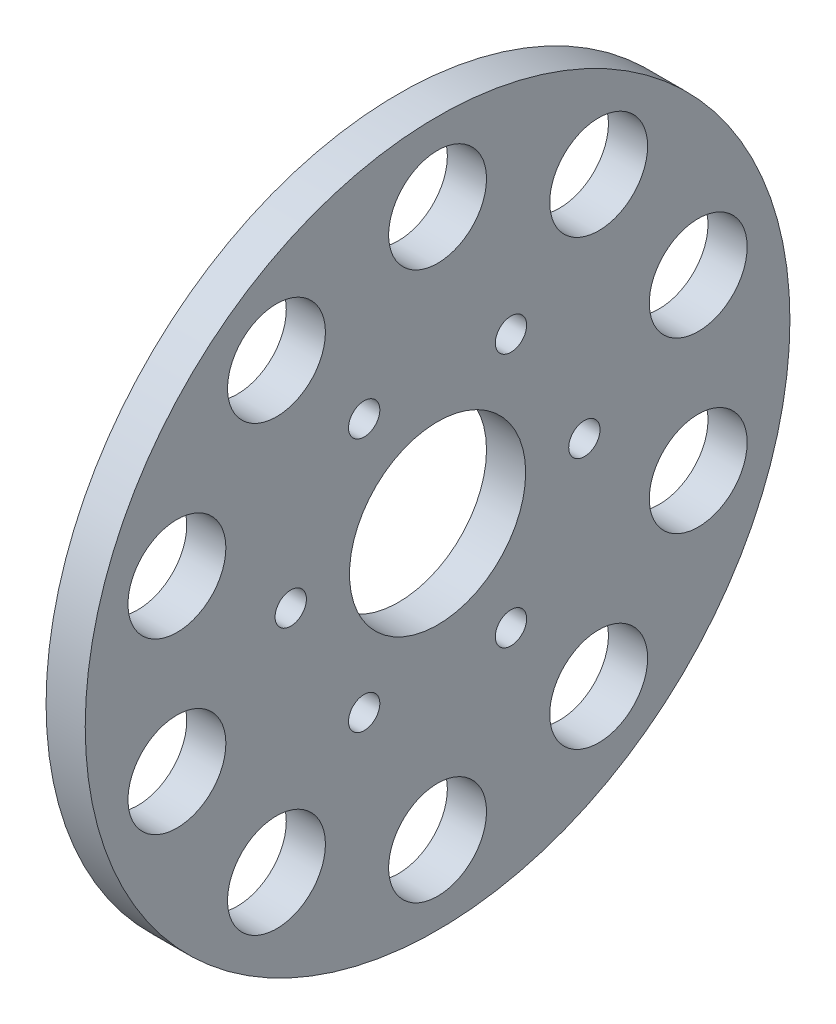
ISO-10303-21;
HEADER;
FILE_DESCRIPTION(('STEP AP214'),'2;1');
FILE_NAME('part.step','',(''),(''),'','','');
FILE_SCHEMA(('AUTOMOTIVE_DESIGN { 1 0 10303 214 1 1 1 1 }'));
ENDSEC;
DATA;
#1=APPLICATION_CONTEXT('core data for automotive mechanical design processes');
#2=APPLICATION_PROTOCOL_DEFINITION('international standard','automotive_design',2000,#1);
#3=PRODUCT_CONTEXT('',#1,'mechanical');
#4=PRODUCT('Part','Part','',(#3));
#5=PRODUCT_RELATED_PRODUCT_CATEGORY('part','',(#4));
#6=PRODUCT_DEFINITION_FORMATION('','',#4);
#7=PRODUCT_DEFINITION_CONTEXT('part definition',#1,'design');
#8=PRODUCT_DEFINITION('design','',#6,#7);
#9=PRODUCT_DEFINITION_SHAPE('','',#8);
#10=(LENGTH_UNIT() NAMED_UNIT(*) SI_UNIT(.MILLI.,.METRE.));
#11=(NAMED_UNIT(*) PLANE_ANGLE_UNIT() SI_UNIT($,.RADIAN.));
#12=(NAMED_UNIT(*) SI_UNIT($,.STERADIAN.) SOLID_ANGLE_UNIT());
#13=UNCERTAINTY_MEASURE_WITH_UNIT(LENGTH_MEASURE(1.E-05),#10,'distance_accuracy_value','');
#14=(GEOMETRIC_REPRESENTATION_CONTEXT(3) GLOBAL_UNCERTAINTY_ASSIGNED_CONTEXT((#13)) GLOBAL_UNIT_ASSIGNED_CONTEXT((#10,
#11,#12)) REPRESENTATION_CONTEXT('',''));
#15=CARTESIAN_POINT('',(0.,0.,0.));
#16=DIRECTION('',(0.,0.,1.));
#17=DIRECTION('',(1.,0.,0.));
#18=AXIS2_PLACEMENT_3D('',#15,#16,#17);
#19=CARTESIAN_POINT('',(6.35,0.,0.));
#20=DIRECTION('',(1.,0.,0.));
#21=DIRECTION('',(0.,0.,-1.));
#22=AXIS2_PLACEMENT_3D('',#19,#20,#21);
#23=PLANE('',#22);
#24=CARTESIAN_POINT('',(6.35,3.21813894591598E-12,-23.8125));
#25=DIRECTION('',(1.,0.,0.));
#26=DIRECTION('',(0.,0.,-1.));
#27=AXIS2_PLACEMENT_3D('',#24,#25,#26);
#28=CIRCLE('',#27,2.54);
#29=CARTESIAN_POINT('',(6.35,3.21813894591598E-12,-26.3525));
#30=VERTEX_POINT('',#29);
#31=EDGE_CURVE('E140',#30,#30,#28,.F.);
#32=ORIENTED_EDGE('',*,*,#31,.T.);
#33=EDGE_LOOP('',(#32));
#34=FACE_BOUND('',#33,.T.);
#35=CARTESIAN_POINT('',(6.35,20.6222299276193,-11.9062499999985));
#36=DIRECTION('',(1.,0.,0.));
#37=DIRECTION('',(0.,0.,-1.));
#38=AXIS2_PLACEMENT_3D('',#35,#36,#37);
#39=CIRCLE('',#38,2.54);
#40=CARTESIAN_POINT('',(6.35,20.6222299276193,-14.4462499999985));
#41=VERTEX_POINT('',#40);
#42=EDGE_CURVE('E134',#41,#41,#39,.F.);
#43=ORIENTED_EDGE('',*,*,#42,.T.);
#44=EDGE_LOOP('',(#43));
#45=FACE_BOUND('',#44,.T.);
#46=CARTESIAN_POINT('',(6.35,20.6222299276175,11.9062500000015));
#47=DIRECTION('',(1.,0.,0.));
#48=DIRECTION('',(0.,0.,-1.));
#49=AXIS2_PLACEMENT_3D('',#46,#47,#48);
#50=CIRCLE('',#49,2.54);
#51=CARTESIAN_POINT('',(6.35,20.6222299276175,9.36625000000155));
#52=VERTEX_POINT('',#51);
#53=EDGE_CURVE('E128',#52,#52,#50,.F.);
#54=ORIENTED_EDGE('',*,*,#53,.T.);
#55=EDGE_LOOP('',(#54));
#56=FACE_BOUND('',#55,.T.);
#57=CARTESIAN_POINT('',(6.35,-3.36908886205967E-13,23.8125));
#58=DIRECTION('',(1.,0.,0.));
#59=DIRECTION('',(0.,0.,-1.));
#60=AXIS2_PLACEMENT_3D('',#57,#58,#59);
#61=CIRCLE('',#60,2.54);
#62=CARTESIAN_POINT('',(6.35,-3.36908886205967E-13,21.2725));
#63=VERTEX_POINT('',#62);
#64=EDGE_CURVE('E122',#63,#63,#61,.F.);
#65=ORIENTED_EDGE('',*,*,#64,.T.);
#66=EDGE_LOOP('',(#65));
#67=FACE_BOUND('',#66,.T.);
#68=CARTESIAN_POINT('',(6.35,-20.6222299276164,11.9062499999984));
#69=DIRECTION('',(1.,0.,0.));
#70=DIRECTION('',(0.,0.,-1.));
#71=AXIS2_PLACEMENT_3D('',#68,#69,#70);
#72=CIRCLE('',#71,2.54);
#73=CARTESIAN_POINT('',(6.35,-20.6222299276164,9.36624999999845));
#74=VERTEX_POINT('',#73);
#75=EDGE_CURVE('E116',#74,#74,#72,.F.);
#76=ORIENTED_EDGE('',*,*,#75,.T.);
#77=EDGE_LOOP('',(#76));
#78=FACE_BOUND('',#77,.T.);
#79=CARTESIAN_POINT('',(6.35,-20.6222299276146,-11.9062500000016));
#80=DIRECTION('',(1.,0.,0.));
#81=DIRECTION('',(0.,0.,-1.));
#82=AXIS2_PLACEMENT_3D('',#79,#80,#81);
#83=CIRCLE('',#82,2.54);
#84=CARTESIAN_POINT('',(6.35,-20.6222299276146,-14.4462500000015));
#85=VERTEX_POINT('',#84);
#86=EDGE_CURVE('E110',#85,#85,#83,.F.);
#87=ORIENTED_EDGE('',*,*,#86,.T.);
#88=EDGE_LOOP('',(#87));
#89=FACE_BOUND('',#88,.T.);
#90=CARTESIAN_POINT('',(6.35,13.7358053999646,42.2744621493183));
#91=DIRECTION('',(1.,0.,0.));
#92=DIRECTION('',(0.,0.,-1.));
#93=AXIS2_PLACEMENT_3D('',#90,#91,#92);
#94=CIRCLE('',#93,7.93750000000225);
#95=CARTESIAN_POINT('',(6.35,13.7358053999646,34.336962149316));
#96=VERTEX_POINT('',#95);
#97=EDGE_CURVE('E95',#96,#96,#94,.T.);
#98=ORIENTED_EDGE('',*,*,#97,.F.);
#99=EDGE_LOOP('',(#98));
#100=FACE_BOUND('',#99,.T.);
#101=CARTESIAN_POINT('',(6.35,-35.9608053999675,26.127054464397));
#102=DIRECTION('',(1.,0.,0.));
#103=DIRECTION('',(0.,0.,-1.));
#104=AXIS2_PLACEMENT_3D('',#101,#102,#103);
#105=CIRCLE('',#104,7.9375000000013);
#106=CARTESIAN_POINT('',(6.35,-35.9608053999675,18.1895544643957));
#107=VERTEX_POINT('',#106);
#108=EDGE_CURVE('E83',#107,#107,#105,.T.);
#109=ORIENTED_EDGE('',*,*,#108,.F.);
#110=EDGE_LOOP('',(#109));
#111=FACE_BOUND('',#110,.T.);
#112=CARTESIAN_POINT('',(6.35,-13.7358053999645,-42.2744621493216));
#113=DIRECTION('',(1.,0.,0.));
#114=DIRECTION('',(0.,0.,-1.));
#115=AXIS2_PLACEMENT_3D('',#112,#113,#114);
#116=CIRCLE('',#115,7.9375);
#117=CARTESIAN_POINT('',(6.35,-13.7358053999645,-50.2119621493216));
#118=VERTEX_POINT('',#117);
#119=EDGE_CURVE('E71',#118,#118,#116,.T.);
#120=ORIENTED_EDGE('',*,*,#119,.F.);
#121=EDGE_LOOP('',(#120));
#122=FACE_BOUND('',#121,.T.);
#123=CARTESIAN_POINT('',(6.35,35.9608053999674,-26.1270544644013));
#124=DIRECTION('',(1.,0.,0.));
#125=DIRECTION('',(0.,0.,-1.));
#126=AXIS2_PLACEMENT_3D('',#123,#124,#125);
#127=CIRCLE('',#126,7.9375);
#128=CARTESIAN_POINT('',(6.35,35.9608053999674,-34.0645544644013));
#129=VERTEX_POINT('',#128);
#130=EDGE_CURVE('E59',#129,#129,#127,.T.);
#131=ORIENTED_EDGE('',*,*,#130,.F.);
#132=EDGE_LOOP('',(#131));
#133=FACE_BOUND('',#132,.T.);
#134=CARTESIAN_POINT('',(6.35,44.45,0.));
#135=DIRECTION('',(1.,0.,0.));
#136=DIRECTION('',(0.,0.,-1.));
#137=AXIS2_PLACEMENT_3D('',#134,#135,#136);
#138=CIRCLE('',#137,7.9375);
#139=CARTESIAN_POINT('',(6.35,44.45,-7.9375));
#140=VERTEX_POINT('',#139);
#141=EDGE_CURVE('E47',#140,#140,#138,.T.);
#142=ORIENTED_EDGE('',*,*,#141,.F.);
#143=EDGE_LOOP('',(#142));
#144=FACE_BOUND('',#143,.T.);
#145=CARTESIAN_POINT('',(6.35,0.,0.));
#146=DIRECTION('',(1.,0.,0.));
#147=DIRECTION('',(0.,0.,-1.));
#148=AXIS2_PLACEMENT_3D('',#145,#146,#147);
#149=CIRCLE('',#148,57.15);
#150=CARTESIAN_POINT('',(6.35,0.,-57.15));
#151=VERTEX_POINT('',#150);
#152=EDGE_CURVE('E10',#151,#151,#149,.T.);
#153=ORIENTED_EDGE('',*,*,#152,.T.);
#154=EDGE_LOOP('',(#153));
#155=FACE_BOUND('',#154,.T.);
#156=CARTESIAN_POINT('',(6.35,0.,0.));
#157=DIRECTION('',(1.,0.,0.));
#158=DIRECTION('',(0.,0.,-1.));
#159=AXIS2_PLACEMENT_3D('',#156,#157,#158);
#160=CIRCLE('',#159,14.2875);
#161=CARTESIAN_POINT('',(6.35,0.,-14.2875));
#162=VERTEX_POINT('',#161);
#163=EDGE_CURVE('E42',#162,#162,#160,.T.);
#164=ORIENTED_EDGE('',*,*,#163,.F.);
#165=EDGE_LOOP('',(#164));
#166=FACE_BOUND('',#165,.T.);
#167=CARTESIAN_POINT('',(6.35,-44.45,-3.77914784249995E-12));
#168=DIRECTION('',(1.,0.,0.));
#169=DIRECTION('',(0.,0.,-1.));
#170=AXIS2_PLACEMENT_3D('',#167,#168,#169);
#171=CIRCLE('',#170,7.93750000000076);
#172=CARTESIAN_POINT('',(6.35,-44.45,-7.93750000000454));
#173=VERTEX_POINT('',#172);
#174=EDGE_CURVE('E53',#173,#173,#171,.T.);
#175=ORIENTED_EDGE('',*,*,#174,.F.);
#176=EDGE_LOOP('',(#175));
#177=FACE_BOUND('',#176,.T.);
#178=CARTESIAN_POINT('',(6.35,13.7358053999681,-42.274462149321));
#179=DIRECTION('',(1.,0.,0.));
#180=DIRECTION('',(0.,0.,-1.));
#181=AXIS2_PLACEMENT_3D('',#178,#179,#180);
#182=CIRCLE('',#181,7.93750000000001);
#183=CARTESIAN_POINT('',(6.35,13.7358053999681,-50.211962149321));
#184=VERTEX_POINT('',#183);
#185=EDGE_CURVE('E65',#184,#184,#182,.T.);
#186=ORIENTED_EDGE('',*,*,#185,.F.);
#187=EDGE_LOOP('',(#186));
#188=FACE_BOUND('',#187,.T.);
#189=CARTESIAN_POINT('',(6.35,-35.9608053999647,-26.1270544644028));
#190=DIRECTION('',(1.,0.,0.));
#191=DIRECTION('',(0.,0.,-1.));
#192=AXIS2_PLACEMENT_3D('',#189,#190,#191);
#193=CIRCLE('',#192,7.93750000000001);
#194=CARTESIAN_POINT('',(6.35,-35.9608053999647,-34.0645544644028));
#195=VERTEX_POINT('',#194);
#196=EDGE_CURVE('E77',#195,#195,#193,.T.);
#197=ORIENTED_EDGE('',*,*,#196,.F.);
#198=EDGE_LOOP('',(#197));
#199=FACE_BOUND('',#198,.T.);
#200=CARTESIAN_POINT('',(6.35,-13.7358053999682,42.2744621493171));
#201=DIRECTION('',(1.,0.,0.));
#202=DIRECTION('',(0.,0.,-1.));
#203=AXIS2_PLACEMENT_3D('',#200,#201,#202);
#204=CIRCLE('',#203,7.93750000000186);
#205=CARTESIAN_POINT('',(6.35,-13.7358053999682,34.3369621493152));
#206=VERTEX_POINT('',#205);
#207=EDGE_CURVE('E89',#206,#206,#204,.T.);
#208=ORIENTED_EDGE('',*,*,#207,.F.);
#209=EDGE_LOOP('',(#208));
#210=FACE_BOUND('',#209,.T.);
#211=CARTESIAN_POINT('',(6.35,35.9608053999653,26.1270544644001));
#212=DIRECTION('',(1.,0.,0.));
#213=DIRECTION('',(0.,0.,-1.));
#214=AXIS2_PLACEMENT_3D('',#211,#212,#213);
#215=CIRCLE('',#214,7.9375000000012);
#216=CARTESIAN_POINT('',(6.35,35.9608053999653,18.1895544643989));
#217=VERTEX_POINT('',#216);
#218=EDGE_CURVE('E101',#217,#217,#215,.T.);
#219=ORIENTED_EDGE('',*,*,#218,.F.);
#220=EDGE_LOOP('',(#219));
#221=FACE_BOUND('',#220,.T.);
#222=ADVANCED_FACE('F31',(#34,#45,#56,#67,#78,#89,#100,#111,#122,#133,#144,#155,#166,#177,#188,
#199,#210,#221),#23,.T.);
#223=CARTESIAN_POINT('',(0.,0.,0.));
#224=DIRECTION('',(1.,0.,0.));
#225=DIRECTION('',(0.,0.,-1.));
#226=AXIS2_PLACEMENT_3D('',#223,#224,#225);
#227=PLANE('',#226);
#228=CARTESIAN_POINT('',(0.,3.21813894591598E-12,-23.8125));
#229=DIRECTION('',(-1.,0.,0.));
#230=DIRECTION('',(0.,0.,1.));
#231=AXIS2_PLACEMENT_3D('',#228,#229,#230);
#232=CIRCLE('',#231,2.54);
#233=CARTESIAN_POINT('',(0.,3.21813894591598E-12,-21.2725));
#234=VERTEX_POINT('',#233);
#235=EDGE_CURVE('E113',#234,#234,#232,.T.);
#236=ORIENTED_EDGE('',*,*,#235,.F.);
#237=EDGE_LOOP('',(#236));
#238=FACE_BOUND('',#237,.T.);
#239=CARTESIAN_POINT('',(0.,20.6222299276193,-11.9062499999985));
#240=DIRECTION('',(-1.,0.,0.));
#241=DIRECTION('',(0.,0.,1.));
#242=AXIS2_PLACEMENT_3D('',#239,#240,#241);
#243=CIRCLE('',#242,2.54);
#244=CARTESIAN_POINT('',(0.,20.6222299276193,-9.36624999999847));
#245=VERTEX_POINT('',#244);
#246=EDGE_CURVE('E137',#245,#245,#243,.T.);
#247=ORIENTED_EDGE('',*,*,#246,.F.);
#248=EDGE_LOOP('',(#247));
#249=FACE_BOUND('',#248,.T.);
#250=CARTESIAN_POINT('',(0.,20.6222299276175,11.9062500000015));
#251=DIRECTION('',(-1.,0.,0.));
#252=DIRECTION('',(0.,0.,1.));
#253=AXIS2_PLACEMENT_3D('',#250,#251,#252);
#254=CIRCLE('',#253,2.54);
#255=CARTESIAN_POINT('',(0.,20.6222299276175,14.4462500000015));
#256=VERTEX_POINT('',#255);
#257=EDGE_CURVE('E131',#256,#256,#254,.T.);
#258=ORIENTED_EDGE('',*,*,#257,.F.);
#259=EDGE_LOOP('',(#258));
#260=FACE_BOUND('',#259,.T.);
#261=CARTESIAN_POINT('',(0.,-3.36908886205967E-13,23.8125));
#262=DIRECTION('',(-1.,0.,0.));
#263=DIRECTION('',(0.,0.,1.));
#264=AXIS2_PLACEMENT_3D('',#261,#262,#263);
#265=CIRCLE('',#264,2.54);
#266=CARTESIAN_POINT('',(0.,-3.36908886205967E-13,26.3525));
#267=VERTEX_POINT('',#266);
#268=EDGE_CURVE('E125',#267,#267,#265,.T.);
#269=ORIENTED_EDGE('',*,*,#268,.F.);
#270=EDGE_LOOP('',(#269));
#271=FACE_BOUND('',#270,.T.);
#272=CARTESIAN_POINT('',(0.,-20.6222299276164,11.9062499999984));
#273=DIRECTION('',(-1.,0.,0.));
#274=DIRECTION('',(0.,0.,1.));
#275=AXIS2_PLACEMENT_3D('',#272,#273,#274);
#276=CIRCLE('',#275,2.54);
#277=CARTESIAN_POINT('',(0.,-20.6222299276164,14.4462499999984));
#278=VERTEX_POINT('',#277);
#279=EDGE_CURVE('E119',#278,#278,#276,.T.);
#280=ORIENTED_EDGE('',*,*,#279,.F.);
#281=EDGE_LOOP('',(#280));
#282=FACE_BOUND('',#281,.T.);
#283=CARTESIAN_POINT('',(0.,-20.6222299276146,-11.9062500000016));
#284=DIRECTION('',(-1.,0.,0.));
#285=DIRECTION('',(0.,0.,1.));
#286=AXIS2_PLACEMENT_3D('',#283,#284,#285);
#287=CIRCLE('',#286,2.54);
#288=CARTESIAN_POINT('',(0.,-20.6222299276146,-9.36625000000156));
#289=VERTEX_POINT('',#288);
#290=EDGE_CURVE('E107',#289,#289,#287,.T.);
#291=ORIENTED_EDGE('',*,*,#290,.F.);
#292=EDGE_LOOP('',(#291));
#293=FACE_BOUND('',#292,.T.);
#294=CARTESIAN_POINT('',(0.,0.,0.));
#295=DIRECTION('',(1.,0.,0.));
#296=DIRECTION('',(0.,0.,-1.));
#297=AXIS2_PLACEMENT_3D('',#294,#295,#296);
#298=CIRCLE('',#297,57.15);
#299=CARTESIAN_POINT('',(0.,0.,-57.15));
#300=VERTEX_POINT('',#299);
#301=EDGE_CURVE('E35',#300,#300,#298,.T.);
#302=ORIENTED_EDGE('',*,*,#301,.F.);
#303=EDGE_LOOP('',(#302));
#304=FACE_BOUND('',#303,.T.);
#305=CARTESIAN_POINT('',(0.,0.,0.));
#306=DIRECTION('',(1.,0.,0.));
#307=DIRECTION('',(0.,0.,-1.));
#308=AXIS2_PLACEMENT_3D('',#305,#306,#307);
#309=CIRCLE('',#308,14.2875);
#310=CARTESIAN_POINT('',(0.,0.,-14.2875));
#311=VERTEX_POINT('',#310);
#312=EDGE_CURVE('E44',#311,#311,#309,.T.);
#313=ORIENTED_EDGE('',*,*,#312,.T.);
#314=EDGE_LOOP('',(#313));
#315=FACE_BOUND('',#314,.T.);
#316=CARTESIAN_POINT('',(0.,44.45,0.));
#317=DIRECTION('',(1.,0.,0.));
#318=DIRECTION('',(0.,0.,-1.));
#319=AXIS2_PLACEMENT_3D('',#316,#317,#318);
#320=CIRCLE('',#319,7.9375);
#321=CARTESIAN_POINT('',(0.,44.45,-7.9375));
#322=VERTEX_POINT('',#321);
#323=EDGE_CURVE('E50',#322,#322,#320,.T.);
#324=ORIENTED_EDGE('',*,*,#323,.T.);
#325=EDGE_LOOP('',(#324));
#326=FACE_BOUND('',#325,.T.);
#327=CARTESIAN_POINT('',(0.,-44.45,-3.77914784249995E-12));
#328=DIRECTION('',(1.,0.,0.));
#329=DIRECTION('',(0.,0.,-1.));
#330=AXIS2_PLACEMENT_3D('',#327,#328,#329);
#331=CIRCLE('',#330,7.93750000000076);
#332=CARTESIAN_POINT('',(0.,-44.45,-7.93750000000454));
#333=VERTEX_POINT('',#332);
#334=EDGE_CURVE('E56',#333,#333,#331,.T.);
#335=ORIENTED_EDGE('',*,*,#334,.T.);
#336=EDGE_LOOP('',(#335));
#337=FACE_BOUND('',#336,.T.);
#338=CARTESIAN_POINT('',(0.,35.9608053999674,-26.1270544644013));
#339=DIRECTION('',(1.,0.,0.));
#340=DIRECTION('',(0.,0.,-1.));
#341=AXIS2_PLACEMENT_3D('',#338,#339,#340);
#342=CIRCLE('',#341,7.9375);
#343=CARTESIAN_POINT('',(0.,35.9608053999674,-34.0645544644013));
#344=VERTEX_POINT('',#343);
#345=EDGE_CURVE('E62',#344,#344,#342,.T.);
#346=ORIENTED_EDGE('',*,*,#345,.T.);
#347=EDGE_LOOP('',(#346));
#348=FACE_BOUND('',#347,.T.);
#349=CARTESIAN_POINT('',(0.,13.7358053999681,-42.274462149321));
#350=DIRECTION('',(1.,0.,0.));
#351=DIRECTION('',(0.,0.,-1.));
#352=AXIS2_PLACEMENT_3D('',#349,#350,#351);
#353=CIRCLE('',#352,7.93750000000001);
#354=CARTESIAN_POINT('',(0.,13.7358053999681,-50.211962149321));
#355=VERTEX_POINT('',#354);
#356=EDGE_CURVE('E68',#355,#355,#353,.T.);
#357=ORIENTED_EDGE('',*,*,#356,.T.);
#358=EDGE_LOOP('',(#357));
#359=FACE_BOUND('',#358,.T.);
#360=CARTESIAN_POINT('',(0.,-13.7358053999645,-42.2744621493216));
#361=DIRECTION('',(1.,0.,0.));
#362=DIRECTION('',(0.,0.,-1.));
#363=AXIS2_PLACEMENT_3D('',#360,#361,#362);
#364=CIRCLE('',#363,7.9375);
#365=CARTESIAN_POINT('',(0.,-13.7358053999645,-50.2119621493216));
#366=VERTEX_POINT('',#365);
#367=EDGE_CURVE('E74',#366,#366,#364,.T.);
#368=ORIENTED_EDGE('',*,*,#367,.T.);
#369=EDGE_LOOP('',(#368));
#370=FACE_BOUND('',#369,.T.);
#371=CARTESIAN_POINT('',(0.,-35.9608053999647,-26.1270544644028));
#372=DIRECTION('',(1.,0.,0.));
#373=DIRECTION('',(0.,0.,-1.));
#374=AXIS2_PLACEMENT_3D('',#371,#372,#373);
#375=CIRCLE('',#374,7.93750000000001);
#376=CARTESIAN_POINT('',(0.,-35.9608053999647,-34.0645544644028));
#377=VERTEX_POINT('',#376);
#378=EDGE_CURVE('E80',#377,#377,#375,.T.);
#379=ORIENTED_EDGE('',*,*,#378,.T.);
#380=EDGE_LOOP('',(#379));
#381=FACE_BOUND('',#380,.T.);
#382=CARTESIAN_POINT('',(0.,-35.9608053999675,26.127054464397));
#383=DIRECTION('',(1.,0.,0.));
#384=DIRECTION('',(0.,0.,-1.));
#385=AXIS2_PLACEMENT_3D('',#382,#383,#384);
#386=CIRCLE('',#385,7.9375000000013);
#387=CARTESIAN_POINT('',(0.,-35.9608053999675,18.1895544643957));
#388=VERTEX_POINT('',#387);
#389=EDGE_CURVE('E86',#388,#388,#386,.T.);
#390=ORIENTED_EDGE('',*,*,#389,.T.);
#391=EDGE_LOOP('',(#390));
#392=FACE_BOUND('',#391,.T.);
#393=CARTESIAN_POINT('',(0.,-13.7358053999682,42.2744621493171));
#394=DIRECTION('',(1.,0.,0.));
#395=DIRECTION('',(0.,0.,-1.));
#396=AXIS2_PLACEMENT_3D('',#393,#394,#395);
#397=CIRCLE('',#396,7.93750000000186);
#398=CARTESIAN_POINT('',(0.,-13.7358053999682,34.3369621493152));
#399=VERTEX_POINT('',#398);
#400=EDGE_CURVE('E92',#399,#399,#397,.T.);
#401=ORIENTED_EDGE('',*,*,#400,.T.);
#402=EDGE_LOOP('',(#401));
#403=FACE_BOUND('',#402,.T.);
#404=CARTESIAN_POINT('',(0.,13.7358053999646,42.2744621493183));
#405=DIRECTION('',(1.,0.,0.));
#406=DIRECTION('',(0.,0.,-1.));
#407=AXIS2_PLACEMENT_3D('',#404,#405,#406);
#408=CIRCLE('',#407,7.93750000000225);
#409=CARTESIAN_POINT('',(0.,13.7358053999646,34.336962149316));
#410=VERTEX_POINT('',#409);
#411=EDGE_CURVE('E98',#410,#410,#408,.T.);
#412=ORIENTED_EDGE('',*,*,#411,.T.);
#413=EDGE_LOOP('',(#412));
#414=FACE_BOUND('',#413,.T.);
#415=CARTESIAN_POINT('',(0.,35.9608053999653,26.1270544644001));
#416=DIRECTION('',(1.,0.,0.));
#417=DIRECTION('',(0.,0.,-1.));
#418=AXIS2_PLACEMENT_3D('',#415,#416,#417);
#419=CIRCLE('',#418,7.9375000000012);
#420=CARTESIAN_POINT('',(0.,35.9608053999653,18.1895544643989));
#421=VERTEX_POINT('',#420);
#422=EDGE_CURVE('E104',#421,#421,#419,.T.);
#423=ORIENTED_EDGE('',*,*,#422,.T.);
#424=EDGE_LOOP('',(#423));
#425=FACE_BOUND('',#424,.T.);
#426=ADVANCED_FACE('F148',(#238,#249,#260,#271,#282,#293,#304,#315,#326,#337,#348,#359,#370,
#381,#392,#403,#414,#425),#227,.F.);
#427=CARTESIAN_POINT('',(6.35,0.,0.));
#428=DIRECTION('',(-1.,0.,0.));
#429=DIRECTION('',(0.,0.,1.));
#430=AXIS2_PLACEMENT_3D('',#427,#428,#429);
#431=CYLINDRICAL_SURFACE('',#430,57.15);
#432=ORIENTED_EDGE('',*,*,#152,.F.);
#433=EDGE_LOOP('',(#432));
#434=FACE_BOUND('',#433,.T.);
#435=ORIENTED_EDGE('',*,*,#301,.T.);
#436=EDGE_LOOP('',(#435));
#437=FACE_BOUND('',#436,.T.);
#438=ADVANCED_FACE('F33',(#434,#437),#431,.T.);
#439=CARTESIAN_POINT('',(6.35,0.,0.));
#440=DIRECTION('',(-1.,0.,0.));
#441=DIRECTION('',(0.,0.,1.));
#442=AXIS2_PLACEMENT_3D('',#439,#440,#441);
#443=CYLINDRICAL_SURFACE('',#442,14.2875);
#444=ORIENTED_EDGE('',*,*,#163,.T.);
#445=EDGE_LOOP('',(#444));
#446=FACE_BOUND('',#445,.T.);
#447=ORIENTED_EDGE('',*,*,#312,.F.);
#448=EDGE_LOOP('',(#447));
#449=FACE_BOUND('',#448,.T.);
#450=ADVANCED_FACE('F208',(#446,#449),#443,.F.);
#451=CARTESIAN_POINT('',(6.35,44.45,0.));
#452=DIRECTION('',(-1.,0.,0.));
#453=DIRECTION('',(0.,0.,1.));
#454=AXIS2_PLACEMENT_3D('',#451,#452,#453);
#455=CYLINDRICAL_SURFACE('',#454,7.9375);
#456=ORIENTED_EDGE('',*,*,#141,.T.);
#457=EDGE_LOOP('',(#456));
#458=FACE_BOUND('',#457,.T.);
#459=ORIENTED_EDGE('',*,*,#323,.F.);
#460=EDGE_LOOP('',(#459));
#461=FACE_BOUND('',#460,.T.);
#462=ADVANCED_FACE('F211',(#458,#461),#455,.F.);
#463=CARTESIAN_POINT('',(6.35,-44.45,-3.77914784249995E-12));
#464=DIRECTION('',(-1.,0.,0.));
#465=DIRECTION('',(0.,0.,1.));
#466=AXIS2_PLACEMENT_3D('',#463,#464,#465);
#467=CYLINDRICAL_SURFACE('',#466,7.93750000000076);
#468=ORIENTED_EDGE('',*,*,#174,.T.);
#469=EDGE_LOOP('',(#468));
#470=FACE_BOUND('',#469,.T.);
#471=ORIENTED_EDGE('',*,*,#334,.F.);
#472=EDGE_LOOP('',(#471));
#473=FACE_BOUND('',#472,.T.);
#474=ADVANCED_FACE('F215',(#470,#473),#467,.F.);
#475=CARTESIAN_POINT('',(6.35,35.9608053999674,-26.1270544644013));
#476=DIRECTION('',(-1.,0.,0.));
#477=DIRECTION('',(0.,0.,1.));
#478=AXIS2_PLACEMENT_3D('',#475,#476,#477);
#479=CYLINDRICAL_SURFACE('',#478,7.9375);
#480=ORIENTED_EDGE('',*,*,#130,.T.);
#481=EDGE_LOOP('',(#480));
#482=FACE_BOUND('',#481,.T.);
#483=ORIENTED_EDGE('',*,*,#345,.F.);
#484=EDGE_LOOP('',(#483));
#485=FACE_BOUND('',#484,.T.);
#486=ADVANCED_FACE('F219',(#482,#485),#479,.F.);
#487=CARTESIAN_POINT('',(6.35,13.7358053999681,-42.274462149321));
#488=DIRECTION('',(-1.,0.,0.));
#489=DIRECTION('',(0.,0.,1.));
#490=AXIS2_PLACEMENT_3D('',#487,#488,#489);
#491=CYLINDRICAL_SURFACE('',#490,7.93750000000001);
#492=ORIENTED_EDGE('',*,*,#185,.T.);
#493=EDGE_LOOP('',(#492));
#494=FACE_BOUND('',#493,.T.);
#495=ORIENTED_EDGE('',*,*,#356,.F.);
#496=EDGE_LOOP('',(#495));
#497=FACE_BOUND('',#496,.T.);
#498=ADVANCED_FACE('F223',(#494,#497),#491,.F.);
#499=CARTESIAN_POINT('',(6.35,-13.7358053999645,-42.2744621493216));
#500=DIRECTION('',(-1.,0.,0.));
#501=DIRECTION('',(0.,0.,1.));
#502=AXIS2_PLACEMENT_3D('',#499,#500,#501);
#503=CYLINDRICAL_SURFACE('',#502,7.9375);
#504=ORIENTED_EDGE('',*,*,#119,.T.);
#505=EDGE_LOOP('',(#504));
#506=FACE_BOUND('',#505,.T.);
#507=ORIENTED_EDGE('',*,*,#367,.F.);
#508=EDGE_LOOP('',(#507));
#509=FACE_BOUND('',#508,.T.);
#510=ADVANCED_FACE('F227',(#506,#509),#503,.F.);
#511=CARTESIAN_POINT('',(6.35,-35.9608053999647,-26.1270544644028));
#512=DIRECTION('',(-1.,0.,0.));
#513=DIRECTION('',(0.,0.,1.));
#514=AXIS2_PLACEMENT_3D('',#511,#512,#513);
#515=CYLINDRICAL_SURFACE('',#514,7.93750000000001);
#516=ORIENTED_EDGE('',*,*,#196,.T.);
#517=EDGE_LOOP('',(#516));
#518=FACE_BOUND('',#517,.T.);
#519=ORIENTED_EDGE('',*,*,#378,.F.);
#520=EDGE_LOOP('',(#519));
#521=FACE_BOUND('',#520,.T.);
#522=ADVANCED_FACE('F231',(#518,#521),#515,.F.);
#523=CARTESIAN_POINT('',(6.35,-35.9608053999675,26.127054464397));
#524=DIRECTION('',(-1.,0.,0.));
#525=DIRECTION('',(0.,0.,1.));
#526=AXIS2_PLACEMENT_3D('',#523,#524,#525);
#527=CYLINDRICAL_SURFACE('',#526,7.9375000000013);
#528=ORIENTED_EDGE('',*,*,#108,.T.);
#529=EDGE_LOOP('',(#528));
#530=FACE_BOUND('',#529,.T.);
#531=ORIENTED_EDGE('',*,*,#389,.F.);
#532=EDGE_LOOP('',(#531));
#533=FACE_BOUND('',#532,.T.);
#534=ADVANCED_FACE('F235',(#530,#533),#527,.F.);
#535=CARTESIAN_POINT('',(6.35,-13.7358053999682,42.2744621493171));
#536=DIRECTION('',(-1.,0.,0.));
#537=DIRECTION('',(0.,0.,1.));
#538=AXIS2_PLACEMENT_3D('',#535,#536,#537);
#539=CYLINDRICAL_SURFACE('',#538,7.93750000000186);
#540=ORIENTED_EDGE('',*,*,#207,.T.);
#541=EDGE_LOOP('',(#540));
#542=FACE_BOUND('',#541,.T.);
#543=ORIENTED_EDGE('',*,*,#400,.F.);
#544=EDGE_LOOP('',(#543));
#545=FACE_BOUND('',#544,.T.);
#546=ADVANCED_FACE('F198',(#542,#545),#539,.F.);
#547=CARTESIAN_POINT('',(6.35,13.7358053999646,42.2744621493183));
#548=DIRECTION('',(-1.,0.,0.));
#549=DIRECTION('',(0.,0.,1.));
#550=AXIS2_PLACEMENT_3D('',#547,#548,#549);
#551=CYLINDRICAL_SURFACE('',#550,7.93750000000225);
#552=ORIENTED_EDGE('',*,*,#97,.T.);
#553=EDGE_LOOP('',(#552));
#554=FACE_BOUND('',#553,.T.);
#555=ORIENTED_EDGE('',*,*,#411,.F.);
#556=EDGE_LOOP('',(#555));
#557=FACE_BOUND('',#556,.T.);
#558=ADVANCED_FACE('F188',(#554,#557),#551,.F.);
#559=CARTESIAN_POINT('',(6.35,35.9608053999653,26.1270544644001));
#560=DIRECTION('',(-1.,0.,0.));
#561=DIRECTION('',(0.,0.,1.));
#562=AXIS2_PLACEMENT_3D('',#559,#560,#561);
#563=CYLINDRICAL_SURFACE('',#562,7.9375000000012);
#564=ORIENTED_EDGE('',*,*,#218,.T.);
#565=EDGE_LOOP('',(#564));
#566=FACE_BOUND('',#565,.T.);
#567=ORIENTED_EDGE('',*,*,#422,.F.);
#568=EDGE_LOOP('',(#567));
#569=FACE_BOUND('',#568,.T.);
#570=ADVANCED_FACE('F185',(#566,#569),#563,.F.);
#571=CARTESIAN_POINT('',(6.351,-20.6222299276146,-11.9062500000016));
#572=DIRECTION('',(-1.,0.,0.));
#573=DIRECTION('',(0.,0.,1.));
#574=AXIS2_PLACEMENT_3D('',#571,#572,#573);
#575=CYLINDRICAL_SURFACE('',#574,2.54);
#576=ORIENTED_EDGE('',*,*,#86,.F.);
#577=EDGE_LOOP('',(#576));
#578=FACE_BOUND('',#577,.T.);
#579=ORIENTED_EDGE('',*,*,#290,.T.);
#580=EDGE_LOOP('',(#579));
#581=FACE_BOUND('',#580,.T.);
#582=ADVANCED_FACE('F187',(#578,#581),#575,.F.);
#583=CARTESIAN_POINT('',(6.351,-20.6222299276164,11.9062499999984));
#584=DIRECTION('',(-1.,0.,0.));
#585=DIRECTION('',(0.,0.,1.));
#586=AXIS2_PLACEMENT_3D('',#583,#584,#585);
#587=CYLINDRICAL_SURFACE('',#586,2.54);
#588=ORIENTED_EDGE('',*,*,#75,.F.);
#589=EDGE_LOOP('',(#588));
#590=FACE_BOUND('',#589,.T.);
#591=ORIENTED_EDGE('',*,*,#279,.T.);
#592=EDGE_LOOP('',(#591));
#593=FACE_BOUND('',#592,.T.);
#594=ADVANCED_FACE('F195',(#590,#593),#587,.F.);
#595=CARTESIAN_POINT('',(6.351,-3.36908886205967E-13,23.8125));
#596=DIRECTION('',(-1.,0.,0.));
#597=DIRECTION('',(0.,0.,1.));
#598=AXIS2_PLACEMENT_3D('',#595,#596,#597);
#599=CYLINDRICAL_SURFACE('',#598,2.54);
#600=ORIENTED_EDGE('',*,*,#64,.F.);
#601=EDGE_LOOP('',(#600));
#602=FACE_BOUND('',#601,.T.);
#603=ORIENTED_EDGE('',*,*,#268,.T.);
#604=EDGE_LOOP('',(#603));
#605=FACE_BOUND('',#604,.T.);
#606=ADVANCED_FACE('F286',(#602,#605),#599,.F.);
#607=CARTESIAN_POINT('',(6.351,20.6222299276175,11.9062500000015));
#608=DIRECTION('',(-1.,0.,0.));
#609=DIRECTION('',(0.,0.,1.));
#610=AXIS2_PLACEMENT_3D('',#607,#608,#609);
#611=CYLINDRICAL_SURFACE('',#610,2.54);
#612=ORIENTED_EDGE('',*,*,#53,.F.);
#613=EDGE_LOOP('',(#612));
#614=FACE_BOUND('',#613,.T.);
#615=ORIENTED_EDGE('',*,*,#257,.T.);
#616=EDGE_LOOP('',(#615));
#617=FACE_BOUND('',#616,.T.);
#618=ADVANCED_FACE('F296',(#614,#617),#611,.F.);
#619=CARTESIAN_POINT('',(6.351,20.6222299276193,-11.9062499999985));
#620=DIRECTION('',(-1.,0.,0.));
#621=DIRECTION('',(0.,0.,1.));
#622=AXIS2_PLACEMENT_3D('',#619,#620,#621);
#623=CYLINDRICAL_SURFACE('',#622,2.54);
#624=ORIENTED_EDGE('',*,*,#42,.F.);
#625=EDGE_LOOP('',(#624));
#626=FACE_BOUND('',#625,.T.);
#627=ORIENTED_EDGE('',*,*,#246,.T.);
#628=EDGE_LOOP('',(#627));
#629=FACE_BOUND('',#628,.T.);
#630=ADVANCED_FACE('F306',(#626,#629),#623,.F.);
#631=CARTESIAN_POINT('',(6.351,3.21813894591598E-12,-23.8125));
#632=DIRECTION('',(-1.,0.,0.));
#633=DIRECTION('',(0.,0.,1.));
#634=AXIS2_PLACEMENT_3D('',#631,#632,#633);
#635=CYLINDRICAL_SURFACE('',#634,2.54);
#636=ORIENTED_EDGE('',*,*,#31,.F.);
#637=EDGE_LOOP('',(#636));
#638=FACE_BOUND('',#637,.T.);
#639=ORIENTED_EDGE('',*,*,#235,.T.);
#640=EDGE_LOOP('',(#639));
#641=FACE_BOUND('',#640,.T.);
#642=ADVANCED_FACE('F146',(#638,#641),#635,.F.);
#643=CLOSED_SHELL('',(#222,#426,#438,#450,#462,#474,#486,#498,#510,#522,#534,#546,#558,#570,
#582,#594,#606,#618,#630,#642));
#644=MANIFOLD_SOLID_BREP('B2',#643);
#645=ADVANCED_BREP_SHAPE_REPRESENTATION('',(#18,#644),#14);
#646=SHAPE_DEFINITION_REPRESENTATION(#9,#645);
ENDSEC;
END-ISO-10303-21;
